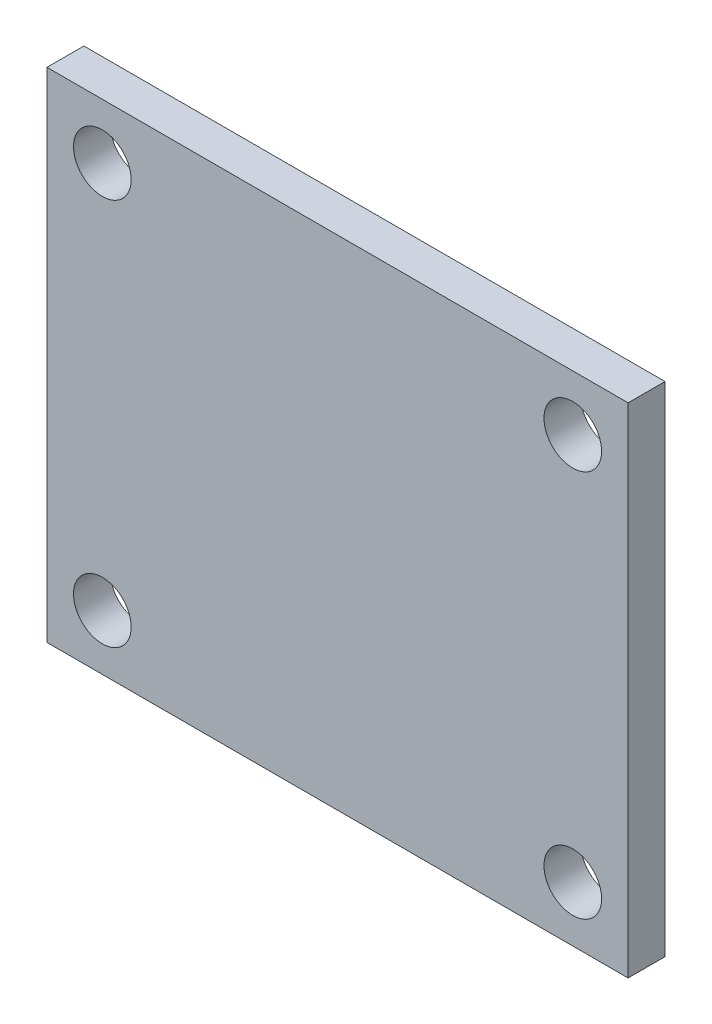
ISO-10303-21;
HEADER;
FILE_DESCRIPTION(('STEP AP214'),'2;1');
FILE_NAME('part.step','',(''),(''),'','','');
FILE_SCHEMA(('AUTOMOTIVE_DESIGN { 1 0 10303 214 1 1 1 1 }'));
ENDSEC;
DATA;
#1=APPLICATION_CONTEXT('core data for automotive mechanical design processes');
#2=APPLICATION_PROTOCOL_DEFINITION('international standard','automotive_design',2000,#1);
#3=PRODUCT_CONTEXT('',#1,'mechanical');
#4=PRODUCT('Part','Part','',(#3));
#5=PRODUCT_RELATED_PRODUCT_CATEGORY('part','',(#4));
#6=PRODUCT_DEFINITION_FORMATION('','',#4);
#7=PRODUCT_DEFINITION_CONTEXT('part definition',#1,'design');
#8=PRODUCT_DEFINITION('design','',#6,#7);
#9=PRODUCT_DEFINITION_SHAPE('','',#8);
#10=(LENGTH_UNIT() NAMED_UNIT(*) SI_UNIT(.MILLI.,.METRE.));
#11=(NAMED_UNIT(*) PLANE_ANGLE_UNIT() SI_UNIT($,.RADIAN.));
#12=(NAMED_UNIT(*) SI_UNIT($,.STERADIAN.) SOLID_ANGLE_UNIT());
#13=UNCERTAINTY_MEASURE_WITH_UNIT(LENGTH_MEASURE(1.E-05),#10,'distance_accuracy_value','');
#14=(GEOMETRIC_REPRESENTATION_CONTEXT(3) GLOBAL_UNCERTAINTY_ASSIGNED_CONTEXT((#13)) GLOBAL_UNIT_ASSIGNED_CONTEXT((#10,
#11,#12)) REPRESENTATION_CONTEXT('',''));
#15=CARTESIAN_POINT('',(0.,0.,0.));
#16=DIRECTION('',(0.,0.,1.));
#17=DIRECTION('',(1.,0.,0.));
#18=AXIS2_PLACEMENT_3D('',#15,#16,#17);
#19=CARTESIAN_POINT('',(0.,0.,0.));
#20=DIRECTION('',(0.,0.,1.));
#21=DIRECTION('',(1.,0.,0.));
#22=AXIS2_PLACEMENT_3D('',#19,#20,#21);
#23=PLANE('',#22);
#24=DIRECTION('',(0.,-1.,0.));
#25=VECTOR('',#24,1.);
#26=CARTESIAN_POINT('',(15.75,0.,0.));
#27=LINE('',#26,#25);
#28=CARTESIAN_POINT('',(15.75,13.5,0.));
#29=VERTEX_POINT('',#28);
#30=CARTESIAN_POINT('',(15.75,-13.5,0.));
#31=VERTEX_POINT('',#30);
#32=EDGE_CURVE('E174',#29,#31,#27,.T.);
#33=ORIENTED_EDGE('',*,*,#32,.T.);
#34=DIRECTION('',(1.,0.,0.));
#35=VECTOR('',#34,1.);
#36=CARTESIAN_POINT('',(0.,-13.5,0.));
#37=LINE('',#36,#35);
#38=CARTESIAN_POINT('',(-15.75,-13.5,0.));
#39=VERTEX_POINT('',#38);
#40=EDGE_CURVE('E142',#39,#31,#37,.T.);
#41=ORIENTED_EDGE('',*,*,#40,.F.);
#42=DIRECTION('',(0.,-1.,0.));
#43=VECTOR('',#42,1.);
#44=CARTESIAN_POINT('',(-15.75,0.,0.));
#45=LINE('',#44,#43);
#46=CARTESIAN_POINT('',(-15.75,13.5,0.));
#47=VERTEX_POINT('',#46);
#48=EDGE_CURVE('E180',#47,#39,#45,.T.);
#49=ORIENTED_EDGE('',*,*,#48,.F.);
#50=DIRECTION('',(1.,0.,0.));
#51=VECTOR('',#50,1.);
#52=CARTESIAN_POINT('',(0.,13.5,0.));
#53=LINE('',#52,#51);
#54=EDGE_CURVE('E177',#47,#29,#53,.T.);
#55=ORIENTED_EDGE('',*,*,#54,.T.);
#56=EDGE_LOOP('',(#33,#41,#49,#55));
#57=FACE_BOUND('',#56,.T.);
#58=CARTESIAN_POINT('',(-12.75,10.5,0.));
#59=DIRECTION('',(0.,0.,1.));
#60=DIRECTION('',(1.,0.,0.));
#61=AXIS2_PLACEMENT_3D('',#58,#59,#60);
#62=CIRCLE('',#61,1.5625);
#63=CARTESIAN_POINT('',(-11.1875,10.5,0.));
#64=VERTEX_POINT('',#63);
#65=EDGE_CURVE('E171',#64,#64,#62,.T.);
#66=ORIENTED_EDGE('',*,*,#65,.T.);
#67=EDGE_LOOP('',(#66));
#68=FACE_BOUND('',#67,.T.);
#69=CARTESIAN_POINT('',(-12.75,-10.5,0.));
#70=DIRECTION('',(0.,0.,1.));
#71=DIRECTION('',(1.,0.,0.));
#72=AXIS2_PLACEMENT_3D('',#69,#70,#71);
#73=CIRCLE('',#72,1.5625);
#74=CARTESIAN_POINT('',(-11.1875,-10.5,0.));
#75=VERTEX_POINT('',#74);
#76=EDGE_CURVE('E168',#75,#75,#73,.T.);
#77=ORIENTED_EDGE('',*,*,#76,.T.);
#78=EDGE_LOOP('',(#77));
#79=FACE_BOUND('',#78,.T.);
#80=CARTESIAN_POINT('',(12.75,10.5,0.));
#81=DIRECTION('',(0.,0.,1.));
#82=DIRECTION('',(1.,0.,0.));
#83=AXIS2_PLACEMENT_3D('',#80,#81,#82);
#84=CIRCLE('',#83,1.5625);
#85=CARTESIAN_POINT('',(14.3125,10.5,0.));
#86=VERTEX_POINT('',#85);
#87=EDGE_CURVE('E165',#86,#86,#84,.T.);
#88=ORIENTED_EDGE('',*,*,#87,.T.);
#89=EDGE_LOOP('',(#88));
#90=FACE_BOUND('',#89,.T.);
#91=CARTESIAN_POINT('',(12.75,-10.5,0.));
#92=DIRECTION('',(0.,0.,1.));
#93=DIRECTION('',(1.,0.,0.));
#94=AXIS2_PLACEMENT_3D('',#91,#92,#93);
#95=CIRCLE('',#94,1.5625);
#96=CARTESIAN_POINT('',(14.3125,-10.5,0.));
#97=VERTEX_POINT('',#96);
#98=EDGE_CURVE('E134',#97,#97,#95,.T.);
#99=ORIENTED_EDGE('',*,*,#98,.T.);
#100=EDGE_LOOP('',(#99));
#101=FACE_BOUND('',#100,.T.);
#102=DIRECTION('',(0.,-1.,0.));
#103=VECTOR('',#102,1.);
#104=CARTESIAN_POINT('',(6.,0.,0.));
#105=LINE('',#104,#103);
#106=CARTESIAN_POINT('',(6.,4.,0.));
#107=VERTEX_POINT('',#106);
#108=CARTESIAN_POINT('',(6.,-4.,0.));
#109=VERTEX_POINT('',#108);
#110=EDGE_CURVE('E129',#107,#109,#105,.T.);
#111=ORIENTED_EDGE('',*,*,#110,.F.);
#112=DIRECTION('',(1.,0.,0.));
#113=VECTOR('',#112,1.);
#114=CARTESIAN_POINT('',(0.,4.,0.));
#115=LINE('',#114,#113);
#116=CARTESIAN_POINT('',(-6.,4.,0.));
#117=VERTEX_POINT('',#116);
#118=EDGE_CURVE('E113',#117,#107,#115,.T.);
#119=ORIENTED_EDGE('',*,*,#118,.F.);
#120=DIRECTION('',(0.,-1.,0.));
#121=VECTOR('',#120,1.);
#122=CARTESIAN_POINT('',(-6.,0.,0.));
#123=LINE('',#122,#121);
#124=CARTESIAN_POINT('',(-6.,-4.,0.));
#125=VERTEX_POINT('',#124);
#126=EDGE_CURVE('E53',#117,#125,#123,.T.);
#127=ORIENTED_EDGE('',*,*,#126,.T.);
#128=DIRECTION('',(1.,0.,0.));
#129=VECTOR('',#128,1.);
#130=CARTESIAN_POINT('',(0.,-4.,0.));
#131=LINE('',#130,#129);
#132=EDGE_CURVE('E48',#125,#109,#131,.T.);
#133=ORIENTED_EDGE('',*,*,#132,.T.);
#134=EDGE_LOOP('',(#111,#119,#127,#133));
#135=FACE_BOUND('',#134,.T.);
#136=ADVANCED_FACE('F33',(#57,#68,#79,#90,#101,#135),#23,.F.);
#137=CARTESIAN_POINT('',(15.75,0.,2.));
#138=DIRECTION('',(1.,0.,0.));
#139=DIRECTION('',(0.,1.,0.));
#140=AXIS2_PLACEMENT_3D('',#137,#138,#139);
#141=PLANE('',#140);
#142=ORIENTED_EDGE('',*,*,#32,.F.);
#143=DIRECTION('',(0.,0.,-1.));
#144=VECTOR('',#143,1.);
#145=CARTESIAN_POINT('',(15.75,13.5,2.));
#146=LINE('',#145,#144);
#147=CARTESIAN_POINT('',(15.75,13.5,2.));
#148=VERTEX_POINT('',#147);
#149=EDGE_CURVE('E41',#148,#29,#146,.T.);
#150=ORIENTED_EDGE('',*,*,#149,.F.);
#151=DIRECTION('',(0.,-1.,0.));
#152=VECTOR('',#151,1.);
#153=CARTESIAN_POINT('',(15.75,0.,2.));
#154=LINE('',#153,#152);
#155=CARTESIAN_POINT('',(15.75,-13.5,2.));
#156=VERTEX_POINT('',#155);
#157=EDGE_CURVE('E151',#148,#156,#154,.T.);
#158=ORIENTED_EDGE('',*,*,#157,.T.);
#159=DIRECTION('',(0.,0.,-1.));
#160=VECTOR('',#159,1.);
#161=CARTESIAN_POINT('',(15.75,-13.5,2.));
#162=LINE('',#161,#160);
#163=EDGE_CURVE('E162',#156,#31,#162,.T.);
#164=ORIENTED_EDGE('',*,*,#163,.T.);
#165=EDGE_LOOP('',(#142,#150,#158,#164));
#166=FACE_BOUND('',#165,.T.);
#167=ADVANCED_FACE('F197',(#166),#141,.T.);
#168=CARTESIAN_POINT('',(0.,13.5,2.));
#169=DIRECTION('',(0.,1.,0.));
#170=DIRECTION('',(0.,0.,1.));
#171=AXIS2_PLACEMENT_3D('',#168,#169,#170);
#172=PLANE('',#171);
#173=ORIENTED_EDGE('',*,*,#54,.F.);
#174=DIRECTION('',(0.,0.,-1.));
#175=VECTOR('',#174,1.);
#176=CARTESIAN_POINT('',(-15.75,13.5,2.));
#177=LINE('',#176,#175);
#178=CARTESIAN_POINT('',(-15.75,13.5,2.));
#179=VERTEX_POINT('',#178);
#180=EDGE_CURVE('E189',#179,#47,#177,.T.);
#181=ORIENTED_EDGE('',*,*,#180,.F.);
#182=DIRECTION('',(1.,0.,0.));
#183=VECTOR('',#182,1.);
#184=CARTESIAN_POINT('',(0.,13.5,2.));
#185=LINE('',#184,#183);
#186=EDGE_CURVE('E154',#179,#148,#185,.T.);
#187=ORIENTED_EDGE('',*,*,#186,.T.);
#188=ORIENTED_EDGE('',*,*,#149,.T.);
#189=EDGE_LOOP('',(#173,#181,#187,#188));
#190=FACE_BOUND('',#189,.T.);
#191=ADVANCED_FACE('F193',(#190),#172,.T.);
#192=CARTESIAN_POINT('',(-15.75,0.,2.));
#193=DIRECTION('',(1.,0.,0.));
#194=DIRECTION('',(0.,1.,0.));
#195=AXIS2_PLACEMENT_3D('',#192,#193,#194);
#196=PLANE('',#195);
#197=ORIENTED_EDGE('',*,*,#48,.T.);
#198=DIRECTION('',(0.,0.,-1.));
#199=VECTOR('',#198,1.);
#200=CARTESIAN_POINT('',(-15.75,-13.5,2.));
#201=LINE('',#200,#199);
#202=CARTESIAN_POINT('',(-15.75,-13.5,2.));
#203=VERTEX_POINT('',#202);
#204=EDGE_CURVE('E186',#203,#39,#201,.T.);
#205=ORIENTED_EDGE('',*,*,#204,.F.);
#206=DIRECTION('',(0.,-1.,0.));
#207=VECTOR('',#206,1.);
#208=CARTESIAN_POINT('',(-15.75,0.,2.));
#209=LINE('',#208,#207);
#210=EDGE_CURVE('E157',#179,#203,#209,.T.);
#211=ORIENTED_EDGE('',*,*,#210,.F.);
#212=ORIENTED_EDGE('',*,*,#180,.T.);
#213=EDGE_LOOP('',(#197,#205,#211,#212));
#214=FACE_BOUND('',#213,.T.);
#215=ADVANCED_FACE('F204',(#214),#196,.F.);
#216=CARTESIAN_POINT('',(-12.75,10.5,2.));
#217=DIRECTION('',(0.,0.,-1.));
#218=DIRECTION('',(-1.,0.,0.));
#219=AXIS2_PLACEMENT_3D('',#216,#217,#218);
#220=CYLINDRICAL_SURFACE('',#219,1.5625);
#221=CARTESIAN_POINT('',(-12.75,10.5,2.));
#222=DIRECTION('',(0.,0.,1.));
#223=DIRECTION('',(1.,0.,0.));
#224=AXIS2_PLACEMENT_3D('',#221,#222,#223);
#225=CIRCLE('',#224,1.5625);
#226=CARTESIAN_POINT('',(-11.1875,10.5,2.));
#227=VERTEX_POINT('',#226);
#228=EDGE_CURVE('E148',#227,#227,#225,.T.);
#229=ORIENTED_EDGE('',*,*,#228,.T.);
#230=EDGE_LOOP('',(#229));
#231=FACE_BOUND('',#230,.T.);
#232=ORIENTED_EDGE('',*,*,#65,.F.);
#233=EDGE_LOOP('',(#232));
#234=FACE_BOUND('',#233,.T.);
#235=ADVANCED_FACE('F326',(#231,#234),#220,.F.);
#236=CARTESIAN_POINT('',(-12.75,-10.5,2.));
#237=DIRECTION('',(0.,0.,-1.));
#238=DIRECTION('',(-1.,0.,0.));
#239=AXIS2_PLACEMENT_3D('',#236,#237,#238);
#240=CYLINDRICAL_SURFACE('',#239,1.5625);
#241=CARTESIAN_POINT('',(-12.75,-10.5,2.));
#242=DIRECTION('',(0.,0.,1.));
#243=DIRECTION('',(1.,0.,0.));
#244=AXIS2_PLACEMENT_3D('',#241,#242,#243);
#245=CIRCLE('',#244,1.5625);
#246=CARTESIAN_POINT('',(-11.1875,-10.5,2.));
#247=VERTEX_POINT('',#246);
#248=EDGE_CURVE('E145',#247,#247,#245,.T.);
#249=ORIENTED_EDGE('',*,*,#248,.T.);
#250=EDGE_LOOP('',(#249));
#251=FACE_BOUND('',#250,.T.);
#252=ORIENTED_EDGE('',*,*,#76,.F.);
#253=EDGE_LOOP('',(#252));
#254=FACE_BOUND('',#253,.T.);
#255=ADVANCED_FACE('F317',(#251,#254),#240,.F.);
#256=CARTESIAN_POINT('',(12.75,10.5,2.));
#257=DIRECTION('',(0.,0.,-1.));
#258=DIRECTION('',(-1.,0.,0.));
#259=AXIS2_PLACEMENT_3D('',#256,#257,#258);
#260=CYLINDRICAL_SURFACE('',#259,1.5625);
#261=CARTESIAN_POINT('',(12.75,10.5,2.));
#262=DIRECTION('',(0.,0.,1.));
#263=DIRECTION('',(1.,0.,0.));
#264=AXIS2_PLACEMENT_3D('',#261,#262,#263);
#265=CIRCLE('',#264,1.5625);
#266=CARTESIAN_POINT('',(14.3125,10.5,2.));
#267=VERTEX_POINT('',#266);
#268=EDGE_CURVE('E141',#267,#267,#265,.T.);
#269=ORIENTED_EDGE('',*,*,#268,.T.);
#270=EDGE_LOOP('',(#269));
#271=FACE_BOUND('',#270,.T.);
#272=ORIENTED_EDGE('',*,*,#87,.F.);
#273=EDGE_LOOP('',(#272));
#274=FACE_BOUND('',#273,.T.);
#275=ADVANCED_FACE('F218',(#271,#274),#260,.F.);
#276=CARTESIAN_POINT('',(12.75,-10.5,2.));
#277=DIRECTION('',(0.,0.,-1.));
#278=DIRECTION('',(-1.,0.,0.));
#279=AXIS2_PLACEMENT_3D('',#276,#277,#278);
#280=CYLINDRICAL_SURFACE('',#279,1.5625);
#281=CARTESIAN_POINT('',(12.75,-10.5,2.));
#282=DIRECTION('',(0.,0.,1.));
#283=DIRECTION('',(1.,0.,0.));
#284=AXIS2_PLACEMENT_3D('',#281,#282,#283);
#285=CIRCLE('',#284,1.5625);
#286=CARTESIAN_POINT('',(14.3125,-10.5,2.));
#287=VERTEX_POINT('',#286);
#288=EDGE_CURVE('E138',#287,#287,#285,.T.);
#289=ORIENTED_EDGE('',*,*,#288,.T.);
#290=EDGE_LOOP('',(#289));
#291=FACE_BOUND('',#290,.T.);
#292=ORIENTED_EDGE('',*,*,#98,.F.);
#293=EDGE_LOOP('',(#292));
#294=FACE_BOUND('',#293,.T.);
#295=ADVANCED_FACE('F35',(#291,#294),#280,.F.);
#296=CARTESIAN_POINT('',(0.,-13.5,2.));
#297=DIRECTION('',(0.,1.,0.));
#298=DIRECTION('',(0.,0.,1.));
#299=AXIS2_PLACEMENT_3D('',#296,#297,#298);
#300=PLANE('',#299);
#301=ORIENTED_EDGE('',*,*,#40,.T.);
#302=ORIENTED_EDGE('',*,*,#163,.F.);
#303=DIRECTION('',(1.,0.,0.));
#304=VECTOR('',#303,1.);
#305=CARTESIAN_POINT('',(0.,-13.5,2.));
#306=LINE('',#305,#304);
#307=EDGE_CURVE('E160',#203,#156,#306,.T.);
#308=ORIENTED_EDGE('',*,*,#307,.F.);
#309=ORIENTED_EDGE('',*,*,#204,.T.);
#310=EDGE_LOOP('',(#301,#302,#308,#309));
#311=FACE_BOUND('',#310,.T.);
#312=ADVANCED_FACE('F209',(#311),#300,.F.);
#313=CARTESIAN_POINT('',(0.,0.,2.));
#314=DIRECTION('',(0.,0.,1.));
#315=DIRECTION('',(1.,0.,0.));
#316=AXIS2_PLACEMENT_3D('',#313,#314,#315);
#317=PLANE('',#316);
#318=ORIENTED_EDGE('',*,*,#288,.F.);
#319=EDGE_LOOP('',(#318));
#320=FACE_BOUND('',#319,.T.);
#321=ORIENTED_EDGE('',*,*,#268,.F.);
#322=EDGE_LOOP('',(#321));
#323=FACE_BOUND('',#322,.T.);
#324=ORIENTED_EDGE('',*,*,#248,.F.);
#325=EDGE_LOOP('',(#324));
#326=FACE_BOUND('',#325,.T.);
#327=ORIENTED_EDGE('',*,*,#228,.F.);
#328=EDGE_LOOP('',(#327));
#329=FACE_BOUND('',#328,.T.);
#330=ORIENTED_EDGE('',*,*,#157,.F.);
#331=ORIENTED_EDGE('',*,*,#186,.F.);
#332=ORIENTED_EDGE('',*,*,#210,.T.);
#333=ORIENTED_EDGE('',*,*,#307,.T.);
#334=EDGE_LOOP('',(#330,#331,#332,#333));
#335=FACE_BOUND('',#334,.T.);
#336=ADVANCED_FACE('F207',(#320,#323,#326,#329,#335),#317,.T.);
#337=CARTESIAN_POINT('',(6.,0.,-1.));
#338=DIRECTION('',(-1.,0.,0.));
#339=DIRECTION('',(0.,-1.,0.));
#340=AXIS2_PLACEMENT_3D('',#337,#338,#339);
#341=PLANE('',#340);
#342=ORIENTED_EDGE('',*,*,#110,.T.);
#343=DIRECTION('',(0.,0.,1.));
#344=VECTOR('',#343,1.);
#345=CARTESIAN_POINT('',(6.,-4.,-1.));
#346=LINE('',#345,#344);
#347=CARTESIAN_POINT('',(6.,-4.,-1.));
#348=VERTEX_POINT('',#347);
#349=EDGE_CURVE('E120',#348,#109,#346,.T.);
#350=ORIENTED_EDGE('',*,*,#349,.F.);
#351=DIRECTION('',(0.,-1.,0.));
#352=VECTOR('',#351,1.);
#353=CARTESIAN_POINT('',(6.,0.,-1.));
#354=LINE('',#353,#352);
#355=CARTESIAN_POINT('',(6.,4.,-1.));
#356=VERTEX_POINT('',#355);
#357=EDGE_CURVE('E102',#356,#348,#354,.T.);
#358=ORIENTED_EDGE('',*,*,#357,.F.);
#359=DIRECTION('',(0.,0.,1.));
#360=VECTOR('',#359,1.);
#361=CARTESIAN_POINT('',(6.,4.,-1.));
#362=LINE('',#361,#360);
#363=EDGE_CURVE('E111',#356,#107,#362,.T.);
#364=ORIENTED_EDGE('',*,*,#363,.T.);
#365=EDGE_LOOP('',(#342,#350,#358,#364));
#366=FACE_BOUND('',#365,.T.);
#367=ADVANCED_FACE('F119',(#366),#341,.F.);
#368=CARTESIAN_POINT('',(0.,-4.,-1.));
#369=DIRECTION('',(0.,-1.,0.));
#370=DIRECTION('',(0.,0.,-1.));
#371=AXIS2_PLACEMENT_3D('',#368,#369,#370);
#372=PLANE('',#371);
#373=ORIENTED_EDGE('',*,*,#132,.F.);
#374=DIRECTION('',(0.,0.,1.));
#375=VECTOR('',#374,1.);
#376=CARTESIAN_POINT('',(-6.,-4.,-1.));
#377=LINE('',#376,#375);
#378=CARTESIAN_POINT('',(-6.,-4.,-1.));
#379=VERTEX_POINT('',#378);
#380=EDGE_CURVE('E135',#379,#125,#377,.T.);
#381=ORIENTED_EDGE('',*,*,#380,.F.);
#382=DIRECTION('',(1.,0.,0.));
#383=VECTOR('',#382,1.);
#384=CARTESIAN_POINT('',(0.,-4.,-1.));
#385=LINE('',#384,#383);
#386=EDGE_CURVE('E117',#379,#348,#385,.T.);
#387=ORIENTED_EDGE('',*,*,#386,.T.);
#388=ORIENTED_EDGE('',*,*,#349,.T.);
#389=EDGE_LOOP('',(#373,#381,#387,#388));
#390=FACE_BOUND('',#389,.T.);
#391=ADVANCED_FACE('F230',(#390),#372,.T.);
#392=CARTESIAN_POINT('',(-6.,0.,-1.));
#393=DIRECTION('',(-1.,0.,0.));
#394=DIRECTION('',(0.,-1.,0.));
#395=AXIS2_PLACEMENT_3D('',#392,#393,#394);
#396=PLANE('',#395);
#397=ORIENTED_EDGE('',*,*,#126,.F.);
#398=DIRECTION('',(0.,0.,1.));
#399=VECTOR('',#398,1.);
#400=CARTESIAN_POINT('',(-6.,4.,-1.));
#401=LINE('',#400,#399);
#402=CARTESIAN_POINT('',(-6.,4.,-1.));
#403=VERTEX_POINT('',#402);
#404=EDGE_CURVE('E116',#403,#117,#401,.T.);
#405=ORIENTED_EDGE('',*,*,#404,.F.);
#406=DIRECTION('',(0.,-1.,0.));
#407=VECTOR('',#406,1.);
#408=CARTESIAN_POINT('',(-6.,0.,-1.));
#409=LINE('',#408,#407);
#410=EDGE_CURVE('E105',#403,#379,#409,.T.);
#411=ORIENTED_EDGE('',*,*,#410,.T.);
#412=ORIENTED_EDGE('',*,*,#380,.T.);
#413=EDGE_LOOP('',(#397,#405,#411,#412));
#414=FACE_BOUND('',#413,.T.);
#415=ADVANCED_FACE('F233',(#414),#396,.T.);
#416=CARTESIAN_POINT('',(0.,4.,-1.));
#417=DIRECTION('',(0.,-1.,0.));
#418=DIRECTION('',(0.,0.,-1.));
#419=AXIS2_PLACEMENT_3D('',#416,#417,#418);
#420=PLANE('',#419);
#421=ORIENTED_EDGE('',*,*,#118,.T.);
#422=ORIENTED_EDGE('',*,*,#363,.F.);
#423=DIRECTION('',(1.,0.,0.));
#424=VECTOR('',#423,1.);
#425=CARTESIAN_POINT('',(0.,4.,-1.));
#426=LINE('',#425,#424);
#427=EDGE_CURVE('E97',#403,#356,#426,.T.);
#428=ORIENTED_EDGE('',*,*,#427,.F.);
#429=ORIENTED_EDGE('',*,*,#404,.T.);
#430=EDGE_LOOP('',(#421,#422,#428,#429));
#431=FACE_BOUND('',#430,.T.);
#432=ADVANCED_FACE('F112',(#431),#420,.F.);
#433=CARTESIAN_POINT('',(0.,0.,-1.));
#434=DIRECTION('',(0.,0.,1.));
#435=DIRECTION('',(1.,0.,0.));
#436=AXIS2_PLACEMENT_3D('',#433,#434,#435);
#437=PLANE('',#436);
#438=CARTESIAN_POINT('',(0.,0.,-1.));
#439=DIRECTION('',(0.,0.,1.));
#440=DIRECTION('',(1.,0.,0.));
#441=AXIS2_PLACEMENT_3D('',#438,#439,#440);
#442=CIRCLE('',#441,1.00338418664736);
#443=CARTESIAN_POINT('',(1.00338418664736,0.,-1.));
#444=VERTEX_POINT('',#443);
#445=EDGE_CURVE('E11',#444,#444,#442,.F.);
#446=ORIENTED_EDGE('',*,*,#445,.F.);
#447=EDGE_LOOP('',(#446));
#448=FACE_BOUND('',#447,.T.);
#449=ORIENTED_EDGE('',*,*,#357,.T.);
#450=ORIENTED_EDGE('',*,*,#386,.F.);
#451=ORIENTED_EDGE('',*,*,#410,.F.);
#452=ORIENTED_EDGE('',*,*,#427,.T.);
#453=EDGE_LOOP('',(#449,#450,#451,#452));
#454=FACE_BOUND('',#453,.T.);
#455=ADVANCED_FACE('F99',(#448,#454),#437,.F.);
#456=CARTESIAN_POINT('',(0.,0.,-1.1));
#457=DIRECTION('',(0.,0.,1.));
#458=DIRECTION('',(1.,0.,0.));
#459=AXIS2_PLACEMENT_3D('',#456,#457,#458);
#460=CYLINDRICAL_SURFACE('',#459,1.00338418664736);
#461=CARTESIAN_POINT('',(0.,0.,-1.1));
#462=DIRECTION('',(0.,0.,-1.));
#463=DIRECTION('',(-1.,0.,0.));
#464=AXIS2_PLACEMENT_3D('',#461,#462,#463);
#465=CIRCLE('',#464,1.00338418664736);
#466=CARTESIAN_POINT('',(-1.00338418664736,0.,-1.1));
#467=VERTEX_POINT('',#466);
#468=EDGE_CURVE('E125',#467,#467,#465,.T.);
#469=ORIENTED_EDGE('',*,*,#468,.F.);
#470=EDGE_LOOP('',(#469));
#471=FACE_BOUND('',#470,.T.);
#472=ORIENTED_EDGE('',*,*,#445,.T.);
#473=EDGE_LOOP('',(#472));
#474=FACE_BOUND('',#473,.T.);
#475=ADVANCED_FACE('F242',(#471,#474),#460,.T.);
#476=CARTESIAN_POINT('',(0.,0.,-1.1));
#477=DIRECTION('',(0.,0.,-1.));
#478=DIRECTION('',(-1.,0.,0.));
#479=AXIS2_PLACEMENT_3D('',#476,#477,#478);
#480=PLANE('',#479);
#481=ORIENTED_EDGE('',*,*,#468,.T.);
#482=EDGE_LOOP('',(#481));
#483=FACE_BOUND('',#482,.T.);
#484=ADVANCED_FACE('F246',(#483),#480,.T.);
#485=CLOSED_SHELL('',(#136,#167,#191,#215,#235,#255,#275,#295,#312,#336,#367,#391,#415,#432,
#455,#475,#484));
#486=MANIFOLD_SOLID_BREP('B2',#485);
#487=ADVANCED_BREP_SHAPE_REPRESENTATION('',(#18,#486),#14);
#488=SHAPE_DEFINITION_REPRESENTATION(#9,#487);
ENDSEC;
END-ISO-10303-21;
